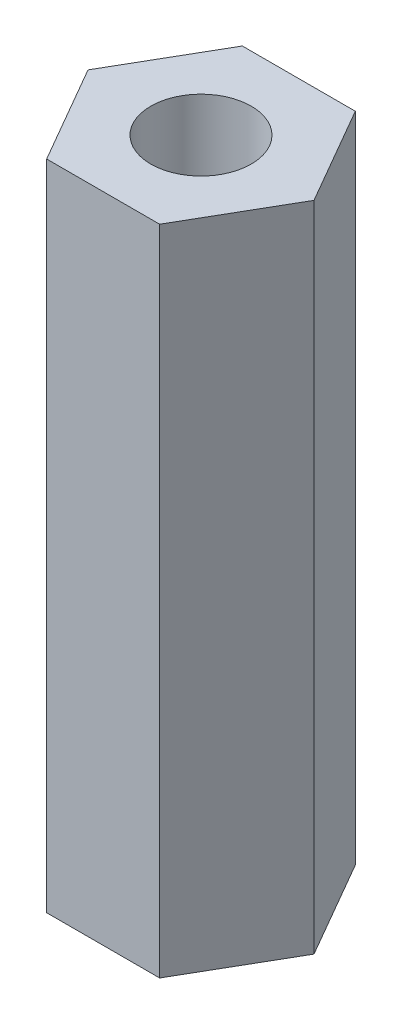
ISO-10303-21;
HEADER;
FILE_DESCRIPTION(('STEP AP214'),'2;1');
FILE_NAME('part.step','',(''),(''),'','','');
FILE_SCHEMA(('AUTOMOTIVE_DESIGN { 1 0 10303 214 1 1 1 1 }'));
ENDSEC;
DATA;
#1=APPLICATION_CONTEXT('core data for automotive mechanical design processes');
#2=APPLICATION_PROTOCOL_DEFINITION('international standard','automotive_design',2000,#1);
#3=PRODUCT_CONTEXT('',#1,'mechanical');
#4=PRODUCT('Part','Part','',(#3));
#5=PRODUCT_RELATED_PRODUCT_CATEGORY('part','',(#4));
#6=PRODUCT_DEFINITION_FORMATION('','',#4);
#7=PRODUCT_DEFINITION_CONTEXT('part definition',#1,'design');
#8=PRODUCT_DEFINITION('design','',#6,#7);
#9=PRODUCT_DEFINITION_SHAPE('','',#8);
#10=(LENGTH_UNIT() NAMED_UNIT(*) SI_UNIT(.MILLI.,.METRE.));
#11=(NAMED_UNIT(*) PLANE_ANGLE_UNIT() SI_UNIT($,.RADIAN.));
#12=(NAMED_UNIT(*) SI_UNIT($,.STERADIAN.) SOLID_ANGLE_UNIT());
#13=UNCERTAINTY_MEASURE_WITH_UNIT(LENGTH_MEASURE(1.E-05),#10,'distance_accuracy_value','');
#14=(GEOMETRIC_REPRESENTATION_CONTEXT(3) GLOBAL_UNCERTAINTY_ASSIGNED_CONTEXT((#13)) GLOBAL_UNIT_ASSIGNED_CONTEXT((#10,
#11,#12)) REPRESENTATION_CONTEXT('',''));
#15=CARTESIAN_POINT('',(0.,0.,0.));
#16=DIRECTION('',(0.,0.,1.));
#17=DIRECTION('',(1.,0.,0.));
#18=AXIS2_PLACEMENT_3D('',#15,#16,#17);
#19=CARTESIAN_POINT('',(0.,13.,0.));
#20=DIRECTION('',(0.,1.,0.));
#21=DIRECTION('',(0.,0.,1.));
#22=AXIS2_PLACEMENT_3D('',#19,#20,#21);
#23=PLANE('',#22);
#24=DIRECTION('',(0.5,0.,-0.866025403784439));
#25=VECTOR('',#24,1.);
#26=CARTESIAN_POINT('',(1.125,13.,1.94855715851499));
#27=LINE('',#26,#25);
#28=CARTESIAN_POINT('',(1.125,13.,1.94855715851499));
#29=VERTEX_POINT('',#28);
#30=CARTESIAN_POINT('',(2.25,13.,0.));
#31=VERTEX_POINT('',#30);
#32=EDGE_CURVE('E129',#29,#31,#27,.T.);
#33=ORIENTED_EDGE('',*,*,#32,.T.);
#34=DIRECTION('',(-0.5,0.,-0.866025403784438));
#35=VECTOR('',#34,1.);
#36=CARTESIAN_POINT('',(2.25,13.,0.));
#37=LINE('',#36,#35);
#38=CARTESIAN_POINT('',(1.125,13.,-1.94855715851499));
#39=VERTEX_POINT('',#38);
#40=EDGE_CURVE('E87',#31,#39,#37,.T.);
#41=ORIENTED_EDGE('',*,*,#40,.T.);
#42=DIRECTION('',(-1.,0.,0.));
#43=VECTOR('',#42,1.);
#44=CARTESIAN_POINT('',(1.125,13.,-1.94855715851499));
#45=LINE('',#44,#43);
#46=CARTESIAN_POINT('',(-1.125,13.,-1.94855715851499));
#47=VERTEX_POINT('',#46);
#48=EDGE_CURVE('E100',#39,#47,#45,.T.);
#49=ORIENTED_EDGE('',*,*,#48,.T.);
#50=DIRECTION('',(-0.5,0.,0.866025403784439));
#51=VECTOR('',#50,1.);
#52=CARTESIAN_POINT('',(-1.125,13.,-1.94855715851499));
#53=LINE('',#52,#51);
#54=CARTESIAN_POINT('',(-2.25,13.,0.));
#55=VERTEX_POINT('',#54);
#56=EDGE_CURVE('E94',#47,#55,#53,.T.);
#57=ORIENTED_EDGE('',*,*,#56,.T.);
#58=DIRECTION('',(0.5,0.,0.866025403784438));
#59=VECTOR('',#58,1.);
#60=CARTESIAN_POINT('',(-2.25,13.,0.));
#61=LINE('',#60,#59);
#62=CARTESIAN_POINT('',(-1.125,13.,1.94855715851499));
#63=VERTEX_POINT('',#62);
#64=EDGE_CURVE('E98',#55,#63,#61,.T.);
#65=ORIENTED_EDGE('',*,*,#64,.T.);
#66=DIRECTION('',(1.,0.,0.));
#67=VECTOR('',#66,1.);
#68=CARTESIAN_POINT('',(-1.125,13.,1.94855715851499));
#69=LINE('',#68,#67);
#70=EDGE_CURVE('E50',#63,#29,#69,.T.);
#71=ORIENTED_EDGE('',*,*,#70,.T.);
#72=EDGE_LOOP('',(#33,#41,#49,#57,#65,#71));
#73=FACE_BOUND('',#72,.T.);
#74=CARTESIAN_POINT('',(0.,13.,0.));
#75=DIRECTION('',(0.,1.,0.));
#76=DIRECTION('',(0.,0.,1.));
#77=AXIS2_PLACEMENT_3D('',#74,#75,#76);
#78=CIRCLE('',#77,1.);
#79=CARTESIAN_POINT('',(0.,13.,1.));
#80=VERTEX_POINT('',#79);
#81=EDGE_CURVE('E122',#80,#80,#78,.T.);
#82=ORIENTED_EDGE('',*,*,#81,.F.);
#83=EDGE_LOOP('',(#82));
#84=FACE_BOUND('',#83,.T.);
#85=ADVANCED_FACE('F33',(#73,#84),#23,.T.);
#86=CARTESIAN_POINT('',(0.,0.,0.));
#87=DIRECTION('',(0.,1.,0.));
#88=DIRECTION('',(0.,0.,1.));
#89=AXIS2_PLACEMENT_3D('',#86,#87,#88);
#90=PLANE('',#89);
#91=DIRECTION('',(0.5,0.,-0.866025403784439));
#92=VECTOR('',#91,1.);
#93=CARTESIAN_POINT('',(1.125,0.,1.94855715851499));
#94=LINE('',#93,#92);
#95=CARTESIAN_POINT('',(1.125,0.,1.94855715851499));
#96=VERTEX_POINT('',#95);
#97=CARTESIAN_POINT('',(2.25,0.,0.));
#98=VERTEX_POINT('',#97);
#99=EDGE_CURVE('E118',#96,#98,#94,.T.);
#100=ORIENTED_EDGE('',*,*,#99,.F.);
#101=DIRECTION('',(1.,0.,0.));
#102=VECTOR('',#101,1.);
#103=CARTESIAN_POINT('',(-1.125,0.,1.94855715851499));
#104=LINE('',#103,#102);
#105=CARTESIAN_POINT('',(-1.125,0.,1.94855715851499));
#106=VERTEX_POINT('',#105);
#107=EDGE_CURVE('E79',#106,#96,#104,.T.);
#108=ORIENTED_EDGE('',*,*,#107,.F.);
#109=DIRECTION('',(0.5,0.,0.866025403784438));
#110=VECTOR('',#109,1.);
#111=CARTESIAN_POINT('',(-2.25,0.,0.));
#112=LINE('',#111,#110);
#113=CARTESIAN_POINT('',(-2.25,0.,0.));
#114=VERTEX_POINT('',#113);
#115=EDGE_CURVE('E73',#114,#106,#112,.T.);
#116=ORIENTED_EDGE('',*,*,#115,.F.);
#117=DIRECTION('',(-0.5,0.,0.866025403784439));
#118=VECTOR('',#117,1.);
#119=CARTESIAN_POINT('',(-1.125,0.,-1.94855715851499));
#120=LINE('',#119,#118);
#121=CARTESIAN_POINT('',(-1.125,0.,-1.94855715851499));
#122=VERTEX_POINT('',#121);
#123=EDGE_CURVE('E108',#122,#114,#120,.T.);
#124=ORIENTED_EDGE('',*,*,#123,.F.);
#125=DIRECTION('',(-1.,0.,0.));
#126=VECTOR('',#125,1.);
#127=CARTESIAN_POINT('',(1.125,0.,-1.94855715851499));
#128=LINE('',#127,#126);
#129=CARTESIAN_POINT('',(1.125,0.,-1.94855715851499));
#130=VERTEX_POINT('',#129);
#131=EDGE_CURVE('E124',#130,#122,#128,.T.);
#132=ORIENTED_EDGE('',*,*,#131,.F.);
#133=DIRECTION('',(-0.5,0.,-0.866025403784438));
#134=VECTOR('',#133,1.);
#135=CARTESIAN_POINT('',(2.25,0.,0.));
#136=LINE('',#135,#134);
#137=EDGE_CURVE('E121',#98,#130,#136,.T.);
#138=ORIENTED_EDGE('',*,*,#137,.F.);
#139=EDGE_LOOP('',(#100,#108,#116,#124,#132,#138));
#140=FACE_BOUND('',#139,.T.);
#141=CARTESIAN_POINT('',(0.,0.,0.));
#142=DIRECTION('',(0.,1.,0.));
#143=DIRECTION('',(0.,0.,1.));
#144=AXIS2_PLACEMENT_3D('',#141,#142,#143);
#145=CIRCLE('',#144,1.);
#146=CARTESIAN_POINT('',(0.,0.,1.));
#147=VERTEX_POINT('',#146);
#148=EDGE_CURVE('E222',#147,#147,#145,.T.);
#149=ORIENTED_EDGE('',*,*,#148,.T.);
#150=EDGE_LOOP('',(#149));
#151=FACE_BOUND('',#150,.T.);
#152=ADVANCED_FACE('F138',(#140,#151),#90,.F.);
#153=CARTESIAN_POINT('',(1.125,13.,1.94855715851499));
#154=DIRECTION('',(-0.866025403784439,0.,-0.5));
#155=DIRECTION('',(-0.5,0.,0.866025403784439));
#156=AXIS2_PLACEMENT_3D('',#153,#154,#155);
#157=PLANE('',#156);
#158=ORIENTED_EDGE('',*,*,#99,.T.);
#159=DIRECTION('',(0.,-1.,0.));
#160=VECTOR('',#159,1.);
#161=CARTESIAN_POINT('',(2.25,13.,0.));
#162=LINE('',#161,#160);
#163=EDGE_CURVE('E11',#31,#98,#162,.T.);
#164=ORIENTED_EDGE('',*,*,#163,.F.);
#165=ORIENTED_EDGE('',*,*,#32,.F.);
#166=DIRECTION('',(0.,-1.,0.));
#167=VECTOR('',#166,1.);
#168=CARTESIAN_POINT('',(1.125,13.,1.94855715851499));
#169=LINE('',#168,#167);
#170=EDGE_CURVE('E114',#29,#96,#169,.T.);
#171=ORIENTED_EDGE('',*,*,#170,.T.);
#172=EDGE_LOOP('',(#158,#164,#165,#171));
#173=FACE_BOUND('',#172,.T.);
#174=ADVANCED_FACE('F35',(#173),#157,.F.);
#175=CARTESIAN_POINT('',(2.25,13.,0.));
#176=DIRECTION('',(-0.866025403784439,0.,0.5));
#177=DIRECTION('',(0.5,0.,0.866025403784439));
#178=AXIS2_PLACEMENT_3D('',#175,#176,#177);
#179=PLANE('',#178);
#180=ORIENTED_EDGE('',*,*,#137,.T.);
#181=DIRECTION('',(0.,-1.,0.));
#182=VECTOR('',#181,1.);
#183=CARTESIAN_POINT('',(1.125,13.,-1.94855715851499));
#184=LINE('',#183,#182);
#185=EDGE_CURVE('E42',#39,#130,#184,.T.);
#186=ORIENTED_EDGE('',*,*,#185,.F.);
#187=ORIENTED_EDGE('',*,*,#40,.F.);
#188=ORIENTED_EDGE('',*,*,#163,.T.);
#189=EDGE_LOOP('',(#180,#186,#187,#188));
#190=FACE_BOUND('',#189,.T.);
#191=ADVANCED_FACE('F163',(#190),#179,.F.);
#192=CARTESIAN_POINT('',(1.125,13.,-1.94855715851499));
#193=DIRECTION('',(0.,0.,1.));
#194=DIRECTION('',(1.,0.,0.));
#195=AXIS2_PLACEMENT_3D('',#192,#193,#194);
#196=PLANE('',#195);
#197=ORIENTED_EDGE('',*,*,#131,.T.);
#198=DIRECTION('',(0.,-1.,0.));
#199=VECTOR('',#198,1.);
#200=CARTESIAN_POINT('',(-1.125,13.,-1.94855715851499));
#201=LINE('',#200,#199);
#202=EDGE_CURVE('E109',#47,#122,#201,.T.);
#203=ORIENTED_EDGE('',*,*,#202,.F.);
#204=ORIENTED_EDGE('',*,*,#48,.F.);
#205=ORIENTED_EDGE('',*,*,#185,.T.);
#206=EDGE_LOOP('',(#197,#203,#204,#205));
#207=FACE_BOUND('',#206,.T.);
#208=ADVANCED_FACE('F135',(#207),#196,.F.);
#209=CARTESIAN_POINT('',(-1.125,13.,-1.94855715851499));
#210=DIRECTION('',(0.866025403784438,0.,0.5));
#211=DIRECTION('',(0.5,0.,-0.866025403784439));
#212=AXIS2_PLACEMENT_3D('',#209,#210,#211);
#213=PLANE('',#212);
#214=ORIENTED_EDGE('',*,*,#123,.T.);
#215=DIRECTION('',(0.,-1.,0.));
#216=VECTOR('',#215,1.);
#217=CARTESIAN_POINT('',(-2.25,13.,0.));
#218=LINE('',#217,#216);
#219=EDGE_CURVE('E105',#55,#114,#218,.T.);
#220=ORIENTED_EDGE('',*,*,#219,.F.);
#221=ORIENTED_EDGE('',*,*,#56,.F.);
#222=ORIENTED_EDGE('',*,*,#202,.T.);
#223=EDGE_LOOP('',(#214,#220,#221,#222));
#224=FACE_BOUND('',#223,.T.);
#225=ADVANCED_FACE('F106',(#224),#213,.F.);
#226=CARTESIAN_POINT('',(-2.25,13.,0.));
#227=DIRECTION('',(0.866025403784438,0.,-0.5));
#228=DIRECTION('',(-0.5,0.,-0.866025403784439));
#229=AXIS2_PLACEMENT_3D('',#226,#227,#228);
#230=PLANE('',#229);
#231=ORIENTED_EDGE('',*,*,#115,.T.);
#232=DIRECTION('',(0.,-1.,0.));
#233=VECTOR('',#232,1.);
#234=CARTESIAN_POINT('',(-1.125,13.,1.94855715851499));
#235=LINE('',#234,#233);
#236=EDGE_CURVE('E110',#63,#106,#235,.T.);
#237=ORIENTED_EDGE('',*,*,#236,.F.);
#238=ORIENTED_EDGE('',*,*,#64,.F.);
#239=ORIENTED_EDGE('',*,*,#219,.T.);
#240=EDGE_LOOP('',(#231,#237,#238,#239));
#241=FACE_BOUND('',#240,.T.);
#242=ADVANCED_FACE('F112',(#241),#230,.F.);
#243=CARTESIAN_POINT('',(-1.125,13.,1.94855715851499));
#244=DIRECTION('',(0.,0.,-1.));
#245=DIRECTION('',(-1.,0.,0.));
#246=AXIS2_PLACEMENT_3D('',#243,#244,#245);
#247=PLANE('',#246);
#248=ORIENTED_EDGE('',*,*,#107,.T.);
#249=ORIENTED_EDGE('',*,*,#170,.F.);
#250=ORIENTED_EDGE('',*,*,#70,.F.);
#251=ORIENTED_EDGE('',*,*,#236,.T.);
#252=EDGE_LOOP('',(#248,#249,#250,#251));
#253=FACE_BOUND('',#252,.T.);
#254=ADVANCED_FACE('F143',(#253),#247,.F.);
#255=CARTESIAN_POINT('',(0.,13.,0.));
#256=DIRECTION('',(0.,-1.,0.));
#257=DIRECTION('',(0.,0.,-1.));
#258=AXIS2_PLACEMENT_3D('',#255,#256,#257);
#259=CYLINDRICAL_SURFACE('',#258,1.);
#260=ORIENTED_EDGE('',*,*,#81,.T.);
#261=EDGE_LOOP('',(#260));
#262=FACE_BOUND('',#261,.T.);
#263=ORIENTED_EDGE('',*,*,#148,.F.);
#264=EDGE_LOOP('',(#263));
#265=FACE_BOUND('',#264,.T.);
#266=ADVANCED_FACE('F145',(#262,#265),#259,.F.);
#267=CLOSED_SHELL('',(#85,#152,#174,#191,#208,#225,#242,#254,#266));
#268=MANIFOLD_SOLID_BREP('B2',#267);
#269=ADVANCED_BREP_SHAPE_REPRESENTATION('',(#18,#268),#14);
#270=SHAPE_DEFINITION_REPRESENTATION(#9,#269);
ENDSEC;
END-ISO-10303-21;
